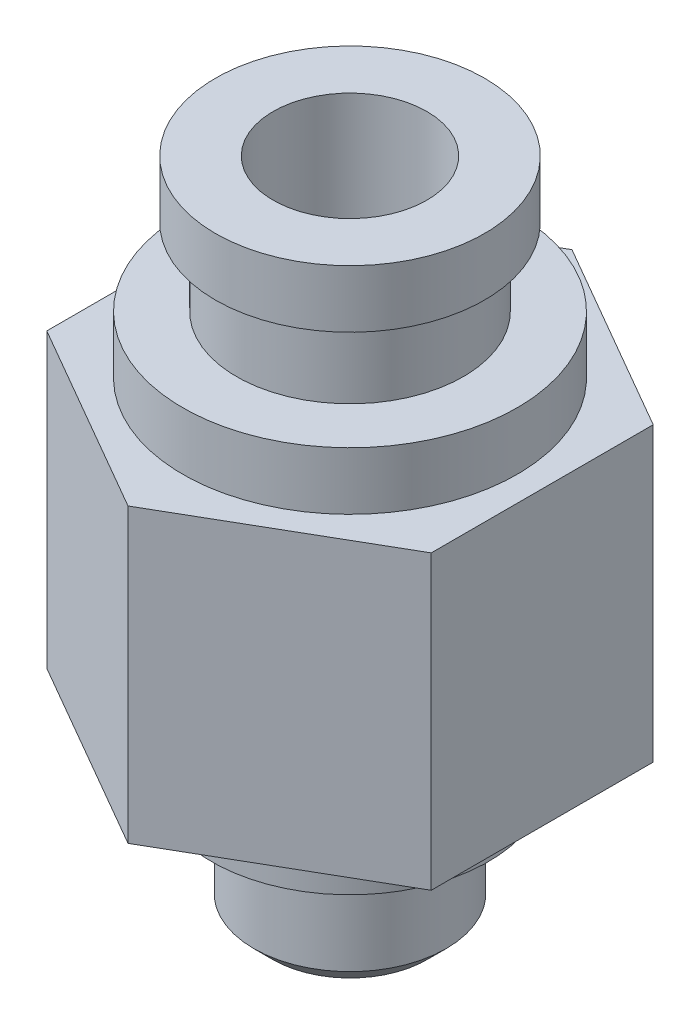
ISO-10303-21;
HEADER;
FILE_DESCRIPTION(('STEP AP214'),'2;1');
FILE_NAME('part.step','',(''),(''),'','','');
FILE_SCHEMA(('AUTOMOTIVE_DESIGN { 1 0 10303 214 1 1 1 1 }'));
ENDSEC;
DATA;
#1=APPLICATION_CONTEXT('core data for automotive mechanical design processes');
#2=APPLICATION_PROTOCOL_DEFINITION('international standard','automotive_design',2000,#1);
#3=PRODUCT_CONTEXT('',#1,'mechanical');
#4=PRODUCT('Part','Part','',(#3));
#5=PRODUCT_RELATED_PRODUCT_CATEGORY('part','',(#4));
#6=PRODUCT_DEFINITION_FORMATION('','',#4);
#7=PRODUCT_DEFINITION_CONTEXT('part definition',#1,'design');
#8=PRODUCT_DEFINITION('design','',#6,#7);
#9=PRODUCT_DEFINITION_SHAPE('','',#8);
#10=(LENGTH_UNIT() NAMED_UNIT(*) SI_UNIT(.MILLI.,.METRE.));
#11=(NAMED_UNIT(*) PLANE_ANGLE_UNIT() SI_UNIT($,.RADIAN.));
#12=(NAMED_UNIT(*) SI_UNIT($,.STERADIAN.) SOLID_ANGLE_UNIT());
#13=UNCERTAINTY_MEASURE_WITH_UNIT(LENGTH_MEASURE(1.E-05),#10,'distance_accuracy_value','');
#14=(GEOMETRIC_REPRESENTATION_CONTEXT(3) GLOBAL_UNCERTAINTY_ASSIGNED_CONTEXT((#13)) GLOBAL_UNIT_ASSIGNED_CONTEXT((#10,
#11,#12)) REPRESENTATION_CONTEXT('',''));
#15=CARTESIAN_POINT('',(0.,0.,0.));
#16=DIRECTION('',(0.,0.,1.));
#17=DIRECTION('',(1.,0.,0.));
#18=AXIS2_PLACEMENT_3D('',#15,#16,#17);
#19=CARTESIAN_POINT('',(0.,4.5,0.));
#20=DIRECTION('',(0.,1.,0.));
#21=DIRECTION('',(0.,0.,1.));
#22=AXIS2_PLACEMENT_3D('',#19,#20,#21);
#23=PLANE('',#22);
#24=CARTESIAN_POINT('',(0.,4.5,0.));
#25=DIRECTION('',(0.,-1.,0.));
#26=DIRECTION('',(0.,0.,-1.));
#27=AXIS2_PLACEMENT_3D('',#24,#25,#26);
#28=CIRCLE('',#27,3.6);
#29=CARTESIAN_POINT('',(0.,4.5,-3.6));
#30=VERTEX_POINT('',#29);
#31=EDGE_CURVE('E20',#30,#30,#28,.T.);
#32=ORIENTED_EDGE('',*,*,#31,.F.);
#33=EDGE_LOOP('',(#32));
#34=FACE_BOUND('',#33,.T.);
#35=DIRECTION('',(-0.866025403784439,0.,0.5));
#36=VECTOR('',#35,1.);
#37=CARTESIAN_POINT('',(0.,4.5,5.77350269189626));
#38=LINE('',#37,#36);
#39=CARTESIAN_POINT('',(5.,4.5,2.88675134594813));
#40=VERTEX_POINT('',#39);
#41=CARTESIAN_POINT('',(0.,4.5,5.77350269189626));
#42=VERTEX_POINT('',#41);
#43=EDGE_CURVE('E68',#40,#42,#38,.T.);
#44=ORIENTED_EDGE('',*,*,#43,.T.);
#45=DIRECTION('',(-0.866025403784439,0.,-0.5));
#46=VECTOR('',#45,1.);
#47=CARTESIAN_POINT('',(-5.,4.5,2.88675134594813));
#48=LINE('',#47,#46);
#49=CARTESIAN_POINT('',(-5.,4.5,2.88675134594813));
#50=VERTEX_POINT('',#49);
#51=EDGE_CURVE('E74',#42,#50,#48,.T.);
#52=ORIENTED_EDGE('',*,*,#51,.T.);
#53=DIRECTION('',(0.,0.,-1.));
#54=VECTOR('',#53,1.);
#55=CARTESIAN_POINT('',(-5.,4.5,-2.88675134594813));
#56=LINE('',#55,#54);
#57=CARTESIAN_POINT('',(-5.,4.5,-2.88675134594813));
#58=VERTEX_POINT('',#57);
#59=EDGE_CURVE('E134',#50,#58,#56,.T.);
#60=ORIENTED_EDGE('',*,*,#59,.T.);
#61=DIRECTION('',(0.866025403784439,0.,-0.5));
#62=VECTOR('',#61,1.);
#63=CARTESIAN_POINT('',(0.,4.5,-5.77350269189626));
#64=LINE('',#63,#62);
#65=CARTESIAN_POINT('',(0.,4.5,-5.77350269189626));
#66=VERTEX_POINT('',#65);
#67=EDGE_CURVE('E146',#58,#66,#64,.T.);
#68=ORIENTED_EDGE('',*,*,#67,.T.);
#69=DIRECTION('',(0.866025403784439,0.,0.5));
#70=VECTOR('',#69,1.);
#71=CARTESIAN_POINT('',(5.,4.5,-2.88675134594813));
#72=LINE('',#71,#70);
#73=CARTESIAN_POINT('',(5.,4.5,-2.88675134594813));
#74=VERTEX_POINT('',#73);
#75=EDGE_CURVE('E152',#66,#74,#72,.T.);
#76=ORIENTED_EDGE('',*,*,#75,.T.);
#77=DIRECTION('',(0.,0.,1.));
#78=VECTOR('',#77,1.);
#79=CARTESIAN_POINT('',(5.,4.5,2.88675134594813));
#80=LINE('',#79,#78);
#81=EDGE_CURVE('E86',#74,#40,#80,.T.);
#82=ORIENTED_EDGE('',*,*,#81,.T.);
#83=EDGE_LOOP('',(#44,#52,#60,#68,#76,#82));
#84=FACE_BOUND('',#83,.T.);
#85=ADVANCED_FACE('F17',(#34,#84),#23,.F.);
#86=CARTESIAN_POINT('',(0.,4.5,0.));
#87=DIRECTION('',(0.,-1.,0.));
#88=DIRECTION('',(0.,0.,-1.));
#89=AXIS2_PLACEMENT_3D('',#86,#87,#88);
#90=CYLINDRICAL_SURFACE('',#89,3.6);
#91=ORIENTED_EDGE('',*,*,#31,.T.);
#92=EDGE_LOOP('',(#91));
#93=FACE_BOUND('',#92,.T.);
#94=CARTESIAN_POINT('',(0.,3.,0.));
#95=DIRECTION('',(0.,-1.,0.));
#96=DIRECTION('',(0.,0.,-1.));
#97=AXIS2_PLACEMENT_3D('',#94,#95,#96);
#98=CIRCLE('',#97,3.6);
#99=CARTESIAN_POINT('',(0.,3.,-3.6));
#100=VERTEX_POINT('',#99);
#101=EDGE_CURVE('E127',#100,#100,#98,.F.);
#102=ORIENTED_EDGE('',*,*,#101,.T.);
#103=EDGE_LOOP('',(#102));
#104=FACE_BOUND('',#103,.T.);
#105=ADVANCED_FACE('F429',(#93,#104),#90,.T.);
#106=CARTESIAN_POINT('',(-5.,12.1,2.88675134594813));
#107=DIRECTION('',(0.5,0.,-0.866025403784439));
#108=DIRECTION('',(-0.866025403784439,0.,-0.5));
#109=AXIS2_PLACEMENT_3D('',#106,#107,#108);
#110=PLANE('',#109);
#111=DIRECTION('',(0.,1.,0.));
#112=VECTOR('',#111,1.);
#113=CARTESIAN_POINT('',(-5.,12.1,2.88675134594813));
#114=LINE('',#113,#112);
#115=CARTESIAN_POINT('',(-5.,12.1,2.88675134594813));
#116=VERTEX_POINT('',#115);
#117=EDGE_CURVE('E79',#116,#50,#114,.F.);
#118=ORIENTED_EDGE('',*,*,#117,.T.);
#119=ORIENTED_EDGE('',*,*,#51,.F.);
#120=DIRECTION('',(0.,1.,0.));
#121=VECTOR('',#120,1.);
#122=CARTESIAN_POINT('',(0.,12.1,5.77350269189626));
#123=LINE('',#122,#121);
#124=CARTESIAN_POINT('',(0.,12.1,5.77350269189626));
#125=VERTEX_POINT('',#124);
#126=EDGE_CURVE('E77',#42,#125,#123,.T.);
#127=ORIENTED_EDGE('',*,*,#126,.T.);
#128=DIRECTION('',(0.866025403784439,0.,0.5));
#129=VECTOR('',#128,1.);
#130=CARTESIAN_POINT('',(-5.,12.1,2.88675134594813));
#131=LINE('',#130,#129);
#132=EDGE_CURVE('E129',#116,#125,#131,.T.);
#133=ORIENTED_EDGE('',*,*,#132,.F.);
#134=EDGE_LOOP('',(#118,#119,#127,#133));
#135=FACE_BOUND('',#134,.T.);
#136=ADVANCED_FACE('F75',(#135),#110,.F.);
#137=CARTESIAN_POINT('',(0.,12.1,5.77350269189626));
#138=DIRECTION('',(-0.5,0.,-0.866025403784439));
#139=DIRECTION('',(-0.866025403784439,0.,0.5));
#140=AXIS2_PLACEMENT_3D('',#137,#138,#139);
#141=PLANE('',#140);
#142=ORIENTED_EDGE('',*,*,#126,.F.);
#143=ORIENTED_EDGE('',*,*,#43,.F.);
#144=DIRECTION('',(0.,1.,0.));
#145=VECTOR('',#144,1.);
#146=CARTESIAN_POINT('',(5.,12.1,2.88675134594813));
#147=LINE('',#146,#145);
#148=CARTESIAN_POINT('',(5.,12.1,2.88675134594813));
#149=VERTEX_POINT('',#148);
#150=EDGE_CURVE('E154',#40,#149,#147,.T.);
#151=ORIENTED_EDGE('',*,*,#150,.T.);
#152=DIRECTION('',(0.866025403784439,0.,-0.5));
#153=VECTOR('',#152,1.);
#154=CARTESIAN_POINT('',(0.,12.1,5.77350269189626));
#155=LINE('',#154,#153);
#156=EDGE_CURVE('E85',#125,#149,#155,.T.);
#157=ORIENTED_EDGE('',*,*,#156,.F.);
#158=EDGE_LOOP('',(#142,#143,#151,#157));
#159=FACE_BOUND('',#158,.T.);
#160=ADVANCED_FACE('F84',(#159),#141,.F.);
#161=CARTESIAN_POINT('',(5.,12.1,2.88675134594813));
#162=DIRECTION('',(-1.,0.,0.));
#163=DIRECTION('',(0.,0.,1.));
#164=AXIS2_PLACEMENT_3D('',#161,#162,#163);
#165=PLANE('',#164);
#166=ORIENTED_EDGE('',*,*,#150,.F.);
#167=ORIENTED_EDGE('',*,*,#81,.F.);
#168=DIRECTION('',(0.,1.,0.));
#169=VECTOR('',#168,1.);
#170=CARTESIAN_POINT('',(5.,12.1,-2.88675134594813));
#171=LINE('',#170,#169);
#172=CARTESIAN_POINT('',(5.,12.1,-2.88675134594813));
#173=VERTEX_POINT('',#172);
#174=EDGE_CURVE('E149',#74,#173,#171,.T.);
#175=ORIENTED_EDGE('',*,*,#174,.T.);
#176=DIRECTION('',(0.,0.,1.));
#177=VECTOR('',#176,1.);
#178=CARTESIAN_POINT('',(5.,12.1,0.));
#179=LINE('',#178,#177);
#180=EDGE_CURVE('E157',#149,#173,#179,.F.);
#181=ORIENTED_EDGE('',*,*,#180,.F.);
#182=EDGE_LOOP('',(#166,#167,#175,#181));
#183=FACE_BOUND('',#182,.T.);
#184=ADVANCED_FACE('F158',(#183),#165,.F.);
#185=CARTESIAN_POINT('',(5.,12.1,-2.88675134594813));
#186=DIRECTION('',(-0.5,0.,0.866025403784439));
#187=DIRECTION('',(0.866025403784439,0.,0.5));
#188=AXIS2_PLACEMENT_3D('',#185,#186,#187);
#189=PLANE('',#188);
#190=ORIENTED_EDGE('',*,*,#174,.F.);
#191=ORIENTED_EDGE('',*,*,#75,.F.);
#192=DIRECTION('',(0.,1.,0.));
#193=VECTOR('',#192,1.);
#194=CARTESIAN_POINT('',(0.,12.1,-5.77350269189626));
#195=LINE('',#194,#193);
#196=CARTESIAN_POINT('',(0.,12.1,-5.77350269189626));
#197=VERTEX_POINT('',#196);
#198=EDGE_CURVE('E143',#66,#197,#195,.T.);
#199=ORIENTED_EDGE('',*,*,#198,.T.);
#200=DIRECTION('',(-0.866025403784439,0.,-0.5));
#201=VECTOR('',#200,1.);
#202=CARTESIAN_POINT('',(5.,12.1,-2.88675134594813));
#203=LINE('',#202,#201);
#204=EDGE_CURVE('E161',#173,#197,#203,.T.);
#205=ORIENTED_EDGE('',*,*,#204,.F.);
#206=EDGE_LOOP('',(#190,#191,#199,#205));
#207=FACE_BOUND('',#206,.T.);
#208=ADVANCED_FACE('F395',(#207),#189,.F.);
#209=CARTESIAN_POINT('',(0.,12.1,-5.77350269189626));
#210=DIRECTION('',(0.5,0.,0.866025403784439));
#211=DIRECTION('',(0.866025403784439,0.,-0.5));
#212=AXIS2_PLACEMENT_3D('',#209,#210,#211);
#213=PLANE('',#212);
#214=ORIENTED_EDGE('',*,*,#198,.F.);
#215=ORIENTED_EDGE('',*,*,#67,.F.);
#216=DIRECTION('',(0.,1.,0.));
#217=VECTOR('',#216,1.);
#218=CARTESIAN_POINT('',(-5.,12.1,-2.88675134594813));
#219=LINE('',#218,#217);
#220=CARTESIAN_POINT('',(-5.,12.1,-2.88675134594813));
#221=VERTEX_POINT('',#220);
#222=EDGE_CURVE('E130',#58,#221,#219,.T.);
#223=ORIENTED_EDGE('',*,*,#222,.T.);
#224=DIRECTION('',(-0.866025403784439,0.,0.5));
#225=VECTOR('',#224,1.);
#226=CARTESIAN_POINT('',(0.,12.1,-5.77350269189626));
#227=LINE('',#226,#225);
#228=EDGE_CURVE('E35',#197,#221,#227,.T.);
#229=ORIENTED_EDGE('',*,*,#228,.F.);
#230=EDGE_LOOP('',(#214,#215,#223,#229));
#231=FACE_BOUND('',#230,.T.);
#232=ADVANCED_FACE('F202',(#231),#213,.F.);
#233=CARTESIAN_POINT('',(-5.,12.1,-2.88675134594813));
#234=DIRECTION('',(1.,0.,0.));
#235=DIRECTION('',(0.,0.,-1.));
#236=AXIS2_PLACEMENT_3D('',#233,#234,#235);
#237=PLANE('',#236);
#238=ORIENTED_EDGE('',*,*,#222,.F.);
#239=ORIENTED_EDGE('',*,*,#59,.F.);
#240=ORIENTED_EDGE('',*,*,#117,.F.);
#241=DIRECTION('',(0.,0.,1.));
#242=VECTOR('',#241,1.);
#243=CARTESIAN_POINT('',(-5.,12.1,0.));
#244=LINE('',#243,#242);
#245=EDGE_CURVE('E126',#221,#116,#244,.T.);
#246=ORIENTED_EDGE('',*,*,#245,.F.);
#247=EDGE_LOOP('',(#238,#239,#240,#246));
#248=FACE_BOUND('',#247,.T.);
#249=ADVANCED_FACE('F193',(#248),#237,.F.);
#250=CARTESIAN_POINT('',(0.,3.,2.0095));
#251=DIRECTION('',(0.,1.,0.));
#252=DIRECTION('',(0.,0.,1.));
#253=AXIS2_PLACEMENT_3D('',#250,#251,#252);
#254=PLANE('',#253);
#255=CARTESIAN_POINT('',(0.,3.00000000004275,0.));
#256=DIRECTION('',(0.,-1.,0.));
#257=DIRECTION('',(0.,0.,-1.));
#258=AXIS2_PLACEMENT_3D('',#255,#256,#257);
#259=CIRCLE('',#258,2.00949999998556);
#260=CARTESIAN_POINT('',(0.,3.00000000004275,-2.00949999998556));
#261=VERTEX_POINT('',#260);
#262=EDGE_CURVE('E124',#261,#261,#259,.T.);
#263=ORIENTED_EDGE('',*,*,#262,.F.);
#264=EDGE_LOOP('',(#263));
#265=FACE_BOUND('',#264,.T.);
#266=ORIENTED_EDGE('',*,*,#101,.F.);
#267=EDGE_LOOP('',(#266));
#268=FACE_BOUND('',#267,.T.);
#269=ADVANCED_FACE('F190',(#265,#268),#254,.F.);
#270=CARTESIAN_POINT('',(0.,12.1,0.));
#271=DIRECTION('',(0.,1.,0.));
#272=DIRECTION('',(0.,0.,1.));
#273=AXIS2_PLACEMENT_3D('',#270,#271,#272);
#274=PLANE('',#273);
#275=CARTESIAN_POINT('',(0.,12.1,0.));
#276=DIRECTION('',(0.,-1.,0.));
#277=DIRECTION('',(0.,0.,-1.));
#278=AXIS2_PLACEMENT_3D('',#275,#276,#277);
#279=CIRCLE('',#278,4.35);
#280=CARTESIAN_POINT('',(0.,12.1,-4.35));
#281=VERTEX_POINT('',#280);
#282=EDGE_CURVE('E121',#281,#281,#279,.F.);
#283=ORIENTED_EDGE('',*,*,#282,.F.);
#284=EDGE_LOOP('',(#283));
#285=FACE_BOUND('',#284,.T.);
#286=ORIENTED_EDGE('',*,*,#228,.T.);
#287=ORIENTED_EDGE('',*,*,#245,.T.);
#288=ORIENTED_EDGE('',*,*,#132,.T.);
#289=ORIENTED_EDGE('',*,*,#156,.T.);
#290=ORIENTED_EDGE('',*,*,#180,.T.);
#291=ORIENTED_EDGE('',*,*,#204,.T.);
#292=EDGE_LOOP('',(#286,#287,#288,#289,#290,#291));
#293=FACE_BOUND('',#292,.T.);
#294=ADVANCED_FACE('F186',(#285,#293),#274,.T.);
#295=CARTESIAN_POINT('',(0.,2.50950000008743,0.));
#296=DIRECTION('',(0.,-1.,0.));
#297=DIRECTION('',(0.,0.,-1.));
#298=AXIS2_PLACEMENT_3D('',#295,#296,#297);
#299=CONICAL_SURFACE('',#298,2.49999999994088,0.785398163397448);
#300=CARTESIAN_POINT('',(0.,2.50949999997374,0.));
#301=DIRECTION('',(0.,-1.,0.));
#302=DIRECTION('',(0.,0.,-1.));
#303=AXIS2_PLACEMENT_3D('',#300,#301,#302);
#304=CIRCLE('',#303,2.5);
#305=CARTESIAN_POINT('',(0.,2.50949999997374,-2.5));
#306=VERTEX_POINT('',#305);
#307=EDGE_CURVE('E120',#306,#306,#304,.T.);
#308=ORIENTED_EDGE('',*,*,#307,.F.);
#309=EDGE_LOOP('',(#308));
#310=FACE_BOUND('',#309,.T.);
#311=ORIENTED_EDGE('',*,*,#262,.T.);
#312=EDGE_LOOP('',(#311));
#313=FACE_BOUND('',#312,.T.);
#314=ADVANCED_FACE('F183',(#310,#313),#299,.T.);
#315=CARTESIAN_POINT('',(0.,17.1,0.));
#316=DIRECTION('',(0.,-1.,0.));
#317=DIRECTION('',(0.,0.,-1.));
#318=AXIS2_PLACEMENT_3D('',#315,#316,#317);
#319=CYLINDRICAL_SURFACE('',#318,4.35);
#320=ORIENTED_EDGE('',*,*,#282,.T.);
#321=EDGE_LOOP('',(#320));
#322=FACE_BOUND('',#321,.T.);
#323=CARTESIAN_POINT('',(0.,13.6,0.));
#324=DIRECTION('',(0.,-1.,0.));
#325=DIRECTION('',(0.,0.,-1.));
#326=AXIS2_PLACEMENT_3D('',#323,#324,#325);
#327=CIRCLE('',#326,4.35);
#328=CARTESIAN_POINT('',(0.,13.6,-4.35));
#329=VERTEX_POINT('',#328);
#330=EDGE_CURVE('E117',#329,#329,#327,.T.);
#331=ORIENTED_EDGE('',*,*,#330,.T.);
#332=EDGE_LOOP('',(#331));
#333=FACE_BOUND('',#332,.T.);
#334=ADVANCED_FACE('F179',(#322,#333),#319,.T.);
#335=CARTESIAN_POINT('',(0.,4.5,0.));
#336=DIRECTION('',(0.,-1.,0.));
#337=DIRECTION('',(0.,0.,-1.));
#338=AXIS2_PLACEMENT_3D('',#335,#336,#337);
#339=CYLINDRICAL_SURFACE('',#338,2.5);
#340=CARTESIAN_POINT('',(0.,0.490499999955318,0.));
#341=DIRECTION('',(0.,1.,0.));
#342=DIRECTION('',(0.,0.,1.));
#343=AXIS2_PLACEMENT_3D('',#340,#341,#342);
#344=CIRCLE('',#343,2.50000000005457);
#345=CARTESIAN_POINT('',(0.,0.490499999955318,2.50000000005457));
#346=VERTEX_POINT('',#345);
#347=EDGE_CURVE('E116',#346,#346,#344,.F.);
#348=ORIENTED_EDGE('',*,*,#347,.F.);
#349=EDGE_LOOP('',(#348));
#350=FACE_BOUND('',#349,.T.);
#351=ORIENTED_EDGE('',*,*,#307,.T.);
#352=EDGE_LOOP('',(#351));
#353=FACE_BOUND('',#352,.T.);
#354=ADVANCED_FACE('F175',(#350,#353),#339,.T.);
#355=CARTESIAN_POINT('',(0.,13.6,4.35));
#356=DIRECTION('',(0.,-1.,0.));
#357=DIRECTION('',(0.,0.,-1.));
#358=AXIS2_PLACEMENT_3D('',#355,#356,#357);
#359=PLANE('',#358);
#360=ORIENTED_EDGE('',*,*,#330,.F.);
#361=EDGE_LOOP('',(#360));
#362=FACE_BOUND('',#361,.T.);
#363=CARTESIAN_POINT('',(0.,13.6,0.));
#364=DIRECTION('',(0.,-1.,0.));
#365=DIRECTION('',(0.,0.,-1.));
#366=AXIS2_PLACEMENT_3D('',#363,#364,#365);
#367=CIRCLE('',#366,2.95);
#368=CARTESIAN_POINT('',(0.,13.6,-2.95));
#369=VERTEX_POINT('',#368);
#370=EDGE_CURVE('E113',#369,#369,#367,.F.);
#371=ORIENTED_EDGE('',*,*,#370,.F.);
#372=EDGE_LOOP('',(#371));
#373=FACE_BOUND('',#372,.T.);
#374=ADVANCED_FACE('F178',(#362,#373),#359,.F.);
#375=CARTESIAN_POINT('',(0.,0.490499999841632,0.));
#376=DIRECTION('',(0.,1.,0.));
#377=DIRECTION('',(0.,0.,1.));
#378=AXIS2_PLACEMENT_3D('',#375,#376,#377);
#379=CONICAL_SURFACE('',#378,2.49999999999773,0.785398163455393);
#380=ORIENTED_EDGE('',*,*,#347,.T.);
#381=EDGE_LOOP('',(#380));
#382=FACE_BOUND('',#381,.T.);
#383=CARTESIAN_POINT('',(0.,-1.13686837721616E-10,0.));
#384=DIRECTION('',(0.,1.,0.));
#385=DIRECTION('',(0.,0.,1.));
#386=AXIS2_PLACEMENT_3D('',#383,#384,#385);
#387=CIRCLE('',#386,2.00949999998556);
#388=CARTESIAN_POINT('',(0.,-1.13686837721616E-10,2.00949999998556));
#389=VERTEX_POINT('',#388);
#390=EDGE_CURVE('E110',#389,#389,#387,.T.);
#391=ORIENTED_EDGE('',*,*,#390,.T.);
#392=EDGE_LOOP('',(#391));
#393=FACE_BOUND('',#392,.T.);
#394=ADVANCED_FACE('F172',(#382,#393),#379,.T.);
#395=CARTESIAN_POINT('',(0.,17.1,0.));
#396=DIRECTION('',(0.,-1.,0.));
#397=DIRECTION('',(0.,0.,-1.));
#398=AXIS2_PLACEMENT_3D('',#395,#396,#397);
#399=CYLINDRICAL_SURFACE('',#398,2.95);
#400=ORIENTED_EDGE('',*,*,#370,.T.);
#401=EDGE_LOOP('',(#400));
#402=FACE_BOUND('',#401,.T.);
#403=CARTESIAN_POINT('',(0.,15.6,0.));
#404=DIRECTION('',(0.,-1.,0.));
#405=DIRECTION('',(0.,0.,-1.));
#406=AXIS2_PLACEMENT_3D('',#403,#404,#405);
#407=CIRCLE('',#406,2.95);
#408=CARTESIAN_POINT('',(0.,15.6,-2.95));
#409=VERTEX_POINT('',#408);
#410=EDGE_CURVE('E107',#409,#409,#407,.T.);
#411=ORIENTED_EDGE('',*,*,#410,.T.);
#412=EDGE_LOOP('',(#411));
#413=FACE_BOUND('',#412,.T.);
#414=ADVANCED_FACE('F237',(#402,#413),#399,.T.);
#415=CARTESIAN_POINT('',(0.,0.,0.));
#416=DIRECTION('',(0.,1.,0.));
#417=DIRECTION('',(0.,0.,1.));
#418=AXIS2_PLACEMENT_3D('',#415,#416,#417);
#419=PLANE('',#418);
#420=CARTESIAN_POINT('',(0.,0.,0.));
#421=DIRECTION('',(0.,1.,0.));
#422=DIRECTION('',(0.,0.,1.));
#423=AXIS2_PLACEMENT_3D('',#420,#421,#422);
#424=CIRCLE('',#423,1.5);
#425=CARTESIAN_POINT('',(0.,0.,1.5));
#426=VERTEX_POINT('',#425);
#427=EDGE_CURVE('E104',#426,#426,#424,.T.);
#428=ORIENTED_EDGE('',*,*,#427,.T.);
#429=EDGE_LOOP('',(#428));
#430=FACE_BOUND('',#429,.T.);
#431=ORIENTED_EDGE('',*,*,#390,.F.);
#432=EDGE_LOOP('',(#431));
#433=FACE_BOUND('',#432,.T.);
#434=ADVANCED_FACE('F233',(#430,#433),#419,.F.);
#435=CARTESIAN_POINT('',(0.,15.6,2.95));
#436=DIRECTION('',(0.,1.,0.));
#437=DIRECTION('',(0.,0.,1.));
#438=AXIS2_PLACEMENT_3D('',#435,#436,#437);
#439=PLANE('',#438);
#440=ORIENTED_EDGE('',*,*,#410,.F.);
#441=EDGE_LOOP('',(#440));
#442=FACE_BOUND('',#441,.T.);
#443=CARTESIAN_POINT('',(0.,15.6,0.));
#444=DIRECTION('',(0.,-1.,0.));
#445=DIRECTION('',(0.,0.,-1.));
#446=AXIS2_PLACEMENT_3D('',#443,#444,#445);
#447=CIRCLE('',#446,3.5);
#448=CARTESIAN_POINT('',(0.,15.6,-3.5));
#449=VERTEX_POINT('',#448);
#450=EDGE_CURVE('E101',#449,#449,#447,.F.);
#451=ORIENTED_EDGE('',*,*,#450,.F.);
#452=EDGE_LOOP('',(#451));
#453=FACE_BOUND('',#452,.T.);
#454=ADVANCED_FACE('F229',(#442,#453),#439,.F.);
#455=CARTESIAN_POINT('',(0.,0.,0.));
#456=DIRECTION('',(0.,1.,0.));
#457=DIRECTION('',(0.,0.,1.));
#458=AXIS2_PLACEMENT_3D('',#455,#456,#457);
#459=CYLINDRICAL_SURFACE('',#458,1.5);
#460=ORIENTED_EDGE('',*,*,#427,.F.);
#461=EDGE_LOOP('',(#460));
#462=FACE_BOUND('',#461,.T.);
#463=CARTESIAN_POINT('',(0.,4.5,0.));
#464=DIRECTION('',(0.,1.,0.));
#465=DIRECTION('',(0.,0.,1.));
#466=AXIS2_PLACEMENT_3D('',#463,#464,#465);
#467=CIRCLE('',#466,1.5);
#468=CARTESIAN_POINT('',(0.,4.5,1.5));
#469=VERTEX_POINT('',#468);
#470=EDGE_CURVE('E98',#469,#469,#467,.F.);
#471=ORIENTED_EDGE('',*,*,#470,.F.);
#472=EDGE_LOOP('',(#471));
#473=FACE_BOUND('',#472,.T.);
#474=ADVANCED_FACE('F225',(#462,#473),#459,.F.);
#475=CARTESIAN_POINT('',(0.,17.1,0.));
#476=DIRECTION('',(0.,-1.,0.));
#477=DIRECTION('',(0.,0.,-1.));
#478=AXIS2_PLACEMENT_3D('',#475,#476,#477);
#479=CYLINDRICAL_SURFACE('',#478,3.5);
#480=ORIENTED_EDGE('',*,*,#450,.T.);
#481=EDGE_LOOP('',(#480));
#482=FACE_BOUND('',#481,.T.);
#483=CARTESIAN_POINT('',(0.,17.1,0.));
#484=DIRECTION('',(0.,-1.,0.));
#485=DIRECTION('',(0.,0.,-1.));
#486=AXIS2_PLACEMENT_3D('',#483,#484,#485);
#487=CIRCLE('',#486,3.5);
#488=CARTESIAN_POINT('',(0.,17.1,-3.5));
#489=VERTEX_POINT('',#488);
#490=EDGE_CURVE('E95',#489,#489,#487,.T.);
#491=ORIENTED_EDGE('',*,*,#490,.T.);
#492=EDGE_LOOP('',(#491));
#493=FACE_BOUND('',#492,.T.);
#494=ADVANCED_FACE('F221',(#482,#493),#479,.T.);
#495=CARTESIAN_POINT('',(0.,4.5,0.));
#496=DIRECTION('',(0.,1.,0.));
#497=DIRECTION('',(0.,0.,1.));
#498=AXIS2_PLACEMENT_3D('',#495,#496,#497);
#499=PLANE('',#498);
#500=ORIENTED_EDGE('',*,*,#470,.T.);
#501=EDGE_LOOP('',(#500));
#502=FACE_BOUND('',#501,.T.);
#503=CARTESIAN_POINT('',(0.,4.5,0.));
#504=DIRECTION('',(0.,-1.,0.));
#505=DIRECTION('',(0.,0.,-1.));
#506=AXIS2_PLACEMENT_3D('',#503,#504,#505);
#507=CIRCLE('',#506,2.);
#508=CARTESIAN_POINT('',(0.,4.5,-2.));
#509=VERTEX_POINT('',#508);
#510=EDGE_CURVE('E26',#509,#509,#507,.F.);
#511=ORIENTED_EDGE('',*,*,#510,.T.);
#512=EDGE_LOOP('',(#511));
#513=FACE_BOUND('',#512,.T.);
#514=ADVANCED_FACE('F213',(#502,#513),#499,.T.);
#515=CARTESIAN_POINT('',(0.,17.1,3.5));
#516=DIRECTION('',(0.,-1.,0.));
#517=DIRECTION('',(0.,0.,-1.));
#518=AXIS2_PLACEMENT_3D('',#515,#516,#517);
#519=PLANE('',#518);
#520=ORIENTED_EDGE('',*,*,#490,.F.);
#521=EDGE_LOOP('',(#520));
#522=FACE_BOUND('',#521,.T.);
#523=CARTESIAN_POINT('',(0.,17.1,0.));
#524=DIRECTION('',(0.,-1.,0.));
#525=DIRECTION('',(0.,0.,-1.));
#526=AXIS2_PLACEMENT_3D('',#523,#524,#525);
#527=CIRCLE('',#526,2.);
#528=CARTESIAN_POINT('',(0.,17.1,-2.));
#529=VERTEX_POINT('',#528);
#530=EDGE_CURVE('E11',#529,#529,#527,.T.);
#531=ORIENTED_EDGE('',*,*,#530,.T.);
#532=EDGE_LOOP('',(#531));
#533=FACE_BOUND('',#532,.T.);
#534=ADVANCED_FACE('F207',(#522,#533),#519,.F.);
#535=CARTESIAN_POINT('',(0.,4.5,0.));
#536=DIRECTION('',(0.,-1.,0.));
#537=DIRECTION('',(0.,0.,-1.));
#538=AXIS2_PLACEMENT_3D('',#535,#536,#537);
#539=CYLINDRICAL_SURFACE('',#538,2.);
#540=ORIENTED_EDGE('',*,*,#510,.F.);
#541=EDGE_LOOP('',(#540));
#542=FACE_BOUND('',#541,.T.);
#543=ORIENTED_EDGE('',*,*,#530,.F.);
#544=EDGE_LOOP('',(#543));
#545=FACE_BOUND('',#544,.T.);
#546=ADVANCED_FACE('F205',(#542,#545),#539,.F.);
#547=CLOSED_SHELL('',(#85,#105,#136,#160,#184,#208,#232,#249,#269,#294,#314,#334,#354,#374,#394,
#414,#434,#454,#474,#494,#514,#534,#546));
#548=MANIFOLD_SOLID_BREP('B1',#547);
#549=ADVANCED_BREP_SHAPE_REPRESENTATION('',(#18,#548),#14);
#550=SHAPE_DEFINITION_REPRESENTATION(#9,#549);
ENDSEC;
END-ISO-10303-21;
